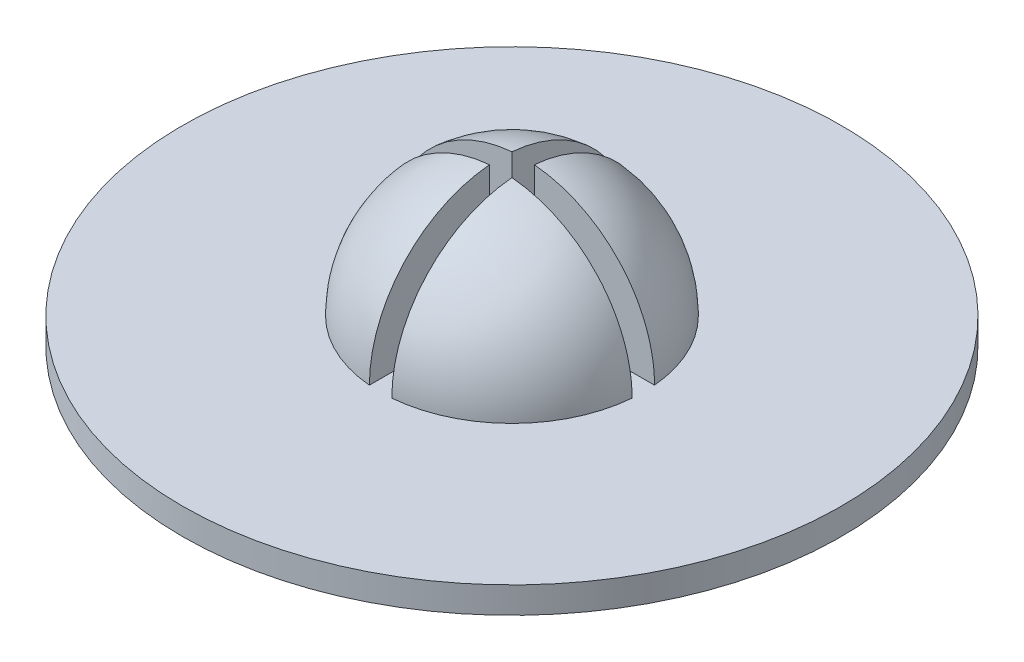
ISO-10303-21;
HEADER;
FILE_DESCRIPTION(('STEP AP214'),'2;1');
FILE_NAME('part.step','',(''),(''),'','','');
FILE_SCHEMA(('AUTOMOTIVE_DESIGN { 1 0 10303 214 1 1 1 1 }'));
ENDSEC;
DATA;
#1=APPLICATION_CONTEXT('core data for automotive mechanical design processes');
#2=APPLICATION_PROTOCOL_DEFINITION('international standard','automotive_design',2000,#1);
#3=PRODUCT_CONTEXT('',#1,'mechanical');
#4=PRODUCT('Part','Part','',(#3));
#5=PRODUCT_RELATED_PRODUCT_CATEGORY('part','',(#4));
#6=PRODUCT_DEFINITION_FORMATION('','',#4);
#7=PRODUCT_DEFINITION_CONTEXT('part definition',#1,'design');
#8=PRODUCT_DEFINITION('design','',#6,#7);
#9=PRODUCT_DEFINITION_SHAPE('','',#8);
#10=(LENGTH_UNIT() NAMED_UNIT(*) SI_UNIT(.MILLI.,.METRE.));
#11=(NAMED_UNIT(*) PLANE_ANGLE_UNIT() SI_UNIT($,.RADIAN.));
#12=(NAMED_UNIT(*) SI_UNIT($,.STERADIAN.) SOLID_ANGLE_UNIT());
#13=UNCERTAINTY_MEASURE_WITH_UNIT(LENGTH_MEASURE(1.E-05),#10,'distance_accuracy_value','');
#14=(GEOMETRIC_REPRESENTATION_CONTEXT(3) GLOBAL_UNCERTAINTY_ASSIGNED_CONTEXT((#13)) GLOBAL_UNIT_ASSIGNED_CONTEXT((#10,
#11,#12)) REPRESENTATION_CONTEXT('',''));
#15=CARTESIAN_POINT('',(0.,0.,0.));
#16=DIRECTION('',(0.,0.,1.));
#17=DIRECTION('',(1.,0.,0.));
#18=AXIS2_PLACEMENT_3D('',#15,#16,#17);
#19=CARTESIAN_POINT('',(0.,0.,0.));
#20=DIRECTION('',(-1.,0.,0.));
#21=DIRECTION('',(0.,0.,1.));
#22=AXIS2_PLACEMENT_3D('',#19,#20,#21);
#23=SPHERICAL_SURFACE('',#22,10.);
#24=CARTESIAN_POINT('',(-0.85,0.,0.));
#25=DIRECTION('',(1.,0.,0.));
#26=DIRECTION('',(0.,0.,-1.));
#27=AXIS2_PLACEMENT_3D('',#24,#25,#26);
#28=CIRCLE('',#27,9.96380951243047);
#29=CARTESIAN_POINT('',(-0.85,0.,-9.96380951243047));
#30=VERTEX_POINT('',#29);
#31=CARTESIAN_POINT('',(-0.85,9.92748709392261,-0.849999999999999));
#32=VERTEX_POINT('',#31);
#33=EDGE_CURVE('E11',#30,#32,#28,.T.);
#34=ORIENTED_EDGE('',*,*,#33,.F.);
#35=CARTESIAN_POINT('',(0.,0.,0.));
#36=DIRECTION('',(0.,-1.,0.));
#37=DIRECTION('',(0.,0.,-1.));
#38=AXIS2_PLACEMENT_3D('',#35,#36,#37);
#39=CIRCLE('',#38,10.);
#40=CARTESIAN_POINT('',(-9.96380951243048,0.,-0.849999999999999));
#41=VERTEX_POINT('',#40);
#42=EDGE_CURVE('E112',#41,#30,#39,.T.);
#43=ORIENTED_EDGE('',*,*,#42,.F.);
#44=CARTESIAN_POINT('',(0.,0.,-0.849999999999999));
#45=DIRECTION('',(0.,0.,-1.));
#46=DIRECTION('',(-1.,0.,0.));
#47=AXIS2_PLACEMENT_3D('',#44,#45,#46);
#48=CIRCLE('',#47,9.96380951243048);
#49=EDGE_CURVE('E51',#41,#32,#48,.T.);
#50=ORIENTED_EDGE('',*,*,#49,.T.);
#51=EDGE_LOOP('',(#34,#43,#50));
#52=FACE_BOUND('',#51,.T.);
#53=ADVANCED_FACE('F43',(#52),#23,.T.);
#54=CARTESIAN_POINT('',(0.,0.,0.85));
#55=DIRECTION('',(0.,0.,-1.));
#56=DIRECTION('',(-1.,0.,0.));
#57=AXIS2_PLACEMENT_3D('',#54,#55,#56);
#58=CIRCLE('',#57,9.96380951243047);
#59=CARTESIAN_POINT('',(-9.96380951243047,0.,0.85));
#60=VERTEX_POINT('',#59);
#61=CARTESIAN_POINT('',(-0.85,9.92748709392261,0.85));
#62=VERTEX_POINT('',#61);
#63=EDGE_CURVE('E165',#60,#62,#58,.T.);
#64=ORIENTED_EDGE('',*,*,#63,.F.);
#65=CARTESIAN_POINT('',(-0.85,0.,9.96380951243047));
#66=VERTEX_POINT('',#65);
#67=EDGE_CURVE('E144',#66,#60,#39,.T.);
#68=ORIENTED_EDGE('',*,*,#67,.F.);
#69=CARTESIAN_POINT('',(-0.85,0.,0.));
#70=DIRECTION('',(1.,0.,0.));
#71=DIRECTION('',(0.,0.,-1.));
#72=AXIS2_PLACEMENT_3D('',#69,#70,#71);
#73=CIRCLE('',#72,9.96380951243047);
#74=EDGE_CURVE('E163',#62,#66,#73,.T.);
#75=ORIENTED_EDGE('',*,*,#74,.F.);
#76=EDGE_LOOP('',(#64,#68,#75));
#77=FACE_BOUND('',#76,.T.);
#78=ADVANCED_FACE('F168',(#77),#23,.T.);
#79=CARTESIAN_POINT('',(0.,0.,0.85));
#80=DIRECTION('',(0.,0.,-1.));
#81=DIRECTION('',(-1.,0.,0.));
#82=AXIS2_PLACEMENT_3D('',#79,#80,#81);
#83=CIRCLE('',#82,9.96380951243047);
#84=CARTESIAN_POINT('',(0.850000000000002,9.92748709392261,0.85));
#85=VERTEX_POINT('',#84);
#86=CARTESIAN_POINT('',(9.96380951243047,0.,0.85));
#87=VERTEX_POINT('',#86);
#88=EDGE_CURVE('E158',#85,#87,#83,.T.);
#89=ORIENTED_EDGE('',*,*,#88,.F.);
#90=CARTESIAN_POINT('',(0.850000000000002,0.,0.));
#91=DIRECTION('',(1.,0.,0.));
#92=DIRECTION('',(0.,0.,-1.));
#93=AXIS2_PLACEMENT_3D('',#90,#91,#92);
#94=CIRCLE('',#93,9.96380951243047);
#95=CARTESIAN_POINT('',(0.850000000000002,0.,9.96380951243047));
#96=VERTEX_POINT('',#95);
#97=EDGE_CURVE('E160',#85,#96,#94,.T.);
#98=ORIENTED_EDGE('',*,*,#97,.T.);
#99=EDGE_CURVE('E195',#87,#96,#39,.T.);
#100=ORIENTED_EDGE('',*,*,#99,.F.);
#101=EDGE_LOOP('',(#89,#98,#100));
#102=FACE_BOUND('',#101,.T.);
#103=ADVANCED_FACE('F175',(#102),#23,.T.);
#104=CARTESIAN_POINT('',(0.,-2.,0.));
#105=DIRECTION('',(0.,1.,0.));
#106=DIRECTION('',(0.,0.,1.));
#107=AXIS2_PLACEMENT_3D('',#104,#105,#106);
#108=CYLINDRICAL_SURFACE('',#107,25.);
#109=CARTESIAN_POINT('',(0.,-2.,0.));
#110=DIRECTION('',(0.,1.,0.));
#111=DIRECTION('',(0.,0.,1.));
#112=AXIS2_PLACEMENT_3D('',#109,#110,#111);
#113=CIRCLE('',#112,25.);
#114=CARTESIAN_POINT('',(0.,-2.,25.));
#115=VERTEX_POINT('',#114);
#116=EDGE_CURVE('E146',#115,#115,#113,.T.);
#117=ORIENTED_EDGE('',*,*,#116,.T.);
#118=EDGE_LOOP('',(#117));
#119=FACE_BOUND('',#118,.T.);
#120=CARTESIAN_POINT('',(0.,0.,0.));
#121=DIRECTION('',(0.,1.,0.));
#122=DIRECTION('',(0.,0.,1.));
#123=AXIS2_PLACEMENT_3D('',#120,#121,#122);
#124=CIRCLE('',#123,25.);
#125=CARTESIAN_POINT('',(0.,0.,25.));
#126=VERTEX_POINT('',#125);
#127=EDGE_CURVE('E150',#126,#126,#124,.T.);
#128=ORIENTED_EDGE('',*,*,#127,.F.);
#129=EDGE_LOOP('',(#128));
#130=FACE_BOUND('',#129,.T.);
#131=ADVANCED_FACE('F45',(#119,#130),#108,.T.);
#132=CARTESIAN_POINT('',(0.,-2.,0.));
#133=DIRECTION('',(0.,1.,0.));
#134=DIRECTION('',(0.,0.,1.));
#135=AXIS2_PLACEMENT_3D('',#132,#133,#134);
#136=PLANE('',#135);
#137=ORIENTED_EDGE('',*,*,#116,.F.);
#138=EDGE_LOOP('',(#137));
#139=FACE_BOUND('',#138,.T.);
#140=ADVANCED_FACE('F185',(#139),#136,.F.);
#141=CARTESIAN_POINT('',(0.,0.,0.));
#142=DIRECTION('',(0.,1.,0.));
#143=DIRECTION('',(0.,0.,1.));
#144=AXIS2_PLACEMENT_3D('',#141,#142,#143);
#145=PLANE('',#144);
#146=DIRECTION('',(1.,0.,0.));
#147=VECTOR('',#146,1.);
#148=CARTESIAN_POINT('',(0.,0.,-0.849999999999999));
#149=LINE('',#148,#147);
#150=CARTESIAN_POINT('',(-0.85,0.,-0.849999999999999));
#151=VERTEX_POINT('',#150);
#152=EDGE_CURVE('E116',#41,#151,#149,.T.);
#153=ORIENTED_EDGE('',*,*,#152,.F.);
#154=ORIENTED_EDGE('',*,*,#42,.T.);
#155=DIRECTION('',(0.,0.,1.));
#156=VECTOR('',#155,1.);
#157=CARTESIAN_POINT('',(-0.85,0.,0.));
#158=LINE('',#157,#156);
#159=EDGE_CURVE('E109',#30,#151,#158,.T.);
#160=ORIENTED_EDGE('',*,*,#159,.T.);
#161=EDGE_LOOP('',(#153,#154,#160));
#162=FACE_BOUND('',#161,.T.);
#163=DIRECTION('',(0.,0.,1.));
#164=VECTOR('',#163,1.);
#165=CARTESIAN_POINT('',(-0.85,0.,0.));
#166=LINE('',#165,#164);
#167=CARTESIAN_POINT('',(-0.85,0.,0.85));
#168=VERTEX_POINT('',#167);
#169=EDGE_CURVE('E58',#168,#66,#166,.T.);
#170=ORIENTED_EDGE('',*,*,#169,.T.);
#171=ORIENTED_EDGE('',*,*,#67,.T.);
#172=DIRECTION('',(1.,0.,0.));
#173=VECTOR('',#172,1.);
#174=CARTESIAN_POINT('',(0.,0.,0.85));
#175=LINE('',#174,#173);
#176=EDGE_CURVE('E121',#60,#168,#175,.T.);
#177=ORIENTED_EDGE('',*,*,#176,.T.);
#178=EDGE_LOOP('',(#170,#171,#177));
#179=FACE_BOUND('',#178,.T.);
#180=ORIENTED_EDGE('',*,*,#99,.T.);
#181=DIRECTION('',(0.,0.,1.));
#182=VECTOR('',#181,1.);
#183=CARTESIAN_POINT('',(0.850000000000002,0.,0.));
#184=LINE('',#183,#182);
#185=CARTESIAN_POINT('',(0.850000000000002,0.,0.85));
#186=VERTEX_POINT('',#185);
#187=EDGE_CURVE('E128',#186,#96,#184,.T.);
#188=ORIENTED_EDGE('',*,*,#187,.F.);
#189=DIRECTION('',(1.,0.,0.));
#190=VECTOR('',#189,1.);
#191=CARTESIAN_POINT('',(0.,0.,0.85));
#192=LINE('',#191,#190);
#193=EDGE_CURVE('E130',#186,#87,#192,.T.);
#194=ORIENTED_EDGE('',*,*,#193,.T.);
#195=EDGE_LOOP('',(#180,#188,#194));
#196=FACE_BOUND('',#195,.T.);
#197=CARTESIAN_POINT('',(0.850000000000002,0.,-9.96380951243047));
#198=VERTEX_POINT('',#197);
#199=CARTESIAN_POINT('',(9.96380951243048,0.,-0.849999999999999));
#200=VERTEX_POINT('',#199);
#201=EDGE_CURVE('E145',#198,#200,#39,.T.);
#202=ORIENTED_EDGE('',*,*,#201,.T.);
#203=DIRECTION('',(1.,0.,0.));
#204=VECTOR('',#203,1.);
#205=CARTESIAN_POINT('',(0.,0.,-0.849999999999999));
#206=LINE('',#205,#204);
#207=CARTESIAN_POINT('',(0.850000000000002,0.,-0.849999999999999));
#208=VERTEX_POINT('',#207);
#209=EDGE_CURVE('E133',#208,#200,#206,.T.);
#210=ORIENTED_EDGE('',*,*,#209,.F.);
#211=DIRECTION('',(0.,0.,1.));
#212=VECTOR('',#211,1.);
#213=CARTESIAN_POINT('',(0.850000000000002,0.,0.));
#214=LINE('',#213,#212);
#215=EDGE_CURVE('E135',#198,#208,#214,.T.);
#216=ORIENTED_EDGE('',*,*,#215,.F.);
#217=EDGE_LOOP('',(#202,#210,#216));
#218=FACE_BOUND('',#217,.T.);
#219=ORIENTED_EDGE('',*,*,#127,.T.);
#220=EDGE_LOOP('',(#219));
#221=FACE_BOUND('',#220,.T.);
#222=ADVANCED_FACE('F123',(#162,#179,#196,#218,#221),#145,.T.);
#223=CARTESIAN_POINT('',(0.850000000000002,0.,0.));
#224=DIRECTION('',(1.,0.,0.));
#225=DIRECTION('',(0.,0.,-1.));
#226=AXIS2_PLACEMENT_3D('',#223,#224,#225);
#227=CIRCLE('',#226,9.96380951243047);
#228=CARTESIAN_POINT('',(0.850000000000002,9.92748709392261,-0.849999999999999));
#229=VERTEX_POINT('',#228);
#230=EDGE_CURVE('E149',#198,#229,#227,.T.);
#231=ORIENTED_EDGE('',*,*,#230,.T.);
#232=CARTESIAN_POINT('',(0.,0.,-0.849999999999999));
#233=DIRECTION('',(0.,0.,-1.));
#234=DIRECTION('',(-1.,0.,0.));
#235=AXIS2_PLACEMENT_3D('',#232,#233,#234);
#236=CIRCLE('',#235,9.96380951243048);
#237=EDGE_CURVE('E155',#229,#200,#236,.T.);
#238=ORIENTED_EDGE('',*,*,#237,.T.);
#239=ORIENTED_EDGE('',*,*,#201,.F.);
#240=EDGE_LOOP('',(#231,#238,#239));
#241=FACE_BOUND('',#240,.T.);
#242=ADVANCED_FACE('F170',(#241),#23,.T.);
#243=CARTESIAN_POINT('',(-0.85,10.,0.));
#244=DIRECTION('',(1.,0.,0.));
#245=DIRECTION('',(0.,0.,-1.));
#246=AXIS2_PLACEMENT_3D('',#243,#244,#245);
#247=PLANE('',#246);
#248=ORIENTED_EDGE('',*,*,#33,.T.);
#249=DIRECTION('',(0.,-1.,0.));
#250=VECTOR('',#249,1.);
#251=CARTESIAN_POINT('',(-0.85,10.,-0.849999999999999));
#252=LINE('',#251,#250);
#253=EDGE_CURVE('E105',#32,#151,#252,.T.);
#254=ORIENTED_EDGE('',*,*,#253,.T.);
#255=ORIENTED_EDGE('',*,*,#159,.F.);
#256=EDGE_LOOP('',(#248,#254,#255));
#257=FACE_BOUND('',#256,.T.);
#258=ADVANCED_FACE('F107',(#257),#247,.T.);
#259=CARTESIAN_POINT('',(0.,10.,-0.849999999999999));
#260=DIRECTION('',(0.,0.,-1.));
#261=DIRECTION('',(-1.,0.,0.));
#262=AXIS2_PLACEMENT_3D('',#259,#260,#261);
#263=PLANE('',#262);
#264=ORIENTED_EDGE('',*,*,#152,.T.);
#265=ORIENTED_EDGE('',*,*,#253,.F.);
#266=ORIENTED_EDGE('',*,*,#49,.F.);
#267=EDGE_LOOP('',(#264,#265,#266));
#268=FACE_BOUND('',#267,.T.);
#269=ADVANCED_FACE('F117',(#268),#263,.F.);
#270=CARTESIAN_POINT('',(0.,10.,0.85));
#271=DIRECTION('',(0.,0.,-1.));
#272=DIRECTION('',(-1.,0.,0.));
#273=AXIS2_PLACEMENT_3D('',#270,#271,#272);
#274=PLANE('',#273);
#275=ORIENTED_EDGE('',*,*,#63,.T.);
#276=DIRECTION('',(0.,-1.,0.));
#277=VECTOR('',#276,1.);
#278=CARTESIAN_POINT('',(-0.85,10.,0.85));
#279=LINE('',#278,#277);
#280=EDGE_CURVE('E113',#62,#168,#279,.T.);
#281=ORIENTED_EDGE('',*,*,#280,.T.);
#282=ORIENTED_EDGE('',*,*,#176,.F.);
#283=EDGE_LOOP('',(#275,#281,#282));
#284=FACE_BOUND('',#283,.T.);
#285=ADVANCED_FACE('F214',(#284),#274,.T.);
#286=CARTESIAN_POINT('',(-0.85,10.,0.));
#287=DIRECTION('',(1.,0.,0.));
#288=DIRECTION('',(0.,0.,-1.));
#289=AXIS2_PLACEMENT_3D('',#286,#287,#288);
#290=PLANE('',#289);
#291=ORIENTED_EDGE('',*,*,#74,.T.);
#292=ORIENTED_EDGE('',*,*,#169,.F.);
#293=ORIENTED_EDGE('',*,*,#280,.F.);
#294=EDGE_LOOP('',(#291,#292,#293));
#295=FACE_BOUND('',#294,.T.);
#296=ADVANCED_FACE('F206',(#295),#290,.T.);
#297=CARTESIAN_POINT('',(0.850000000000002,10.,0.));
#298=DIRECTION('',(1.,0.,0.));
#299=DIRECTION('',(0.,0.,-1.));
#300=AXIS2_PLACEMENT_3D('',#297,#298,#299);
#301=PLANE('',#300);
#302=DIRECTION('',(0.,-1.,0.));
#303=VECTOR('',#302,1.);
#304=CARTESIAN_POINT('',(0.850000000000002,10.,0.85));
#305=LINE('',#304,#303);
#306=EDGE_CURVE('E140',#85,#186,#305,.T.);
#307=ORIENTED_EDGE('',*,*,#306,.T.);
#308=ORIENTED_EDGE('',*,*,#187,.T.);
#309=ORIENTED_EDGE('',*,*,#97,.F.);
#310=EDGE_LOOP('',(#307,#308,#309));
#311=FACE_BOUND('',#310,.T.);
#312=ADVANCED_FACE('F204',(#311),#301,.F.);
#313=CARTESIAN_POINT('',(0.,10.,0.85));
#314=DIRECTION('',(0.,0.,-1.));
#315=DIRECTION('',(-1.,0.,0.));
#316=AXIS2_PLACEMENT_3D('',#313,#314,#315);
#317=PLANE('',#316);
#318=ORIENTED_EDGE('',*,*,#88,.T.);
#319=ORIENTED_EDGE('',*,*,#193,.F.);
#320=ORIENTED_EDGE('',*,*,#306,.F.);
#321=EDGE_LOOP('',(#318,#319,#320));
#322=FACE_BOUND('',#321,.T.);
#323=ADVANCED_FACE('F199',(#322),#317,.T.);
#324=CARTESIAN_POINT('',(0.,10.,-0.849999999999999));
#325=DIRECTION('',(0.,0.,-1.));
#326=DIRECTION('',(-1.,0.,0.));
#327=AXIS2_PLACEMENT_3D('',#324,#325,#326);
#328=PLANE('',#327);
#329=DIRECTION('',(0.,-1.,0.));
#330=VECTOR('',#329,1.);
#331=CARTESIAN_POINT('',(0.850000000000002,10.,-0.849999999999999));
#332=LINE('',#331,#330);
#333=EDGE_CURVE('E138',#229,#208,#332,.T.);
#334=ORIENTED_EDGE('',*,*,#333,.T.);
#335=ORIENTED_EDGE('',*,*,#209,.T.);
#336=ORIENTED_EDGE('',*,*,#237,.F.);
#337=EDGE_LOOP('',(#334,#335,#336));
#338=FACE_BOUND('',#337,.T.);
#339=ADVANCED_FACE('F212',(#338),#328,.F.);
#340=CARTESIAN_POINT('',(0.850000000000002,10.,0.));
#341=DIRECTION('',(1.,0.,0.));
#342=DIRECTION('',(0.,0.,-1.));
#343=AXIS2_PLACEMENT_3D('',#340,#341,#342);
#344=PLANE('',#343);
#345=ORIENTED_EDGE('',*,*,#215,.T.);
#346=ORIENTED_EDGE('',*,*,#333,.F.);
#347=ORIENTED_EDGE('',*,*,#230,.F.);
#348=EDGE_LOOP('',(#345,#346,#347));
#349=FACE_BOUND('',#348,.T.);
#350=ADVANCED_FACE('F257',(#349),#344,.F.);
#351=CLOSED_SHELL('',(#53,#78,#103,#131,#140,#222,#242,#258,#269,#285,#296,#312,#323,#339,#350));
#352=MANIFOLD_SOLID_BREP('B2',#351);
#353=ADVANCED_BREP_SHAPE_REPRESENTATION('',(#18,#352),#14);
#354=SHAPE_DEFINITION_REPRESENTATION(#9,#353);
ENDSEC;
END-ISO-10303-21;
